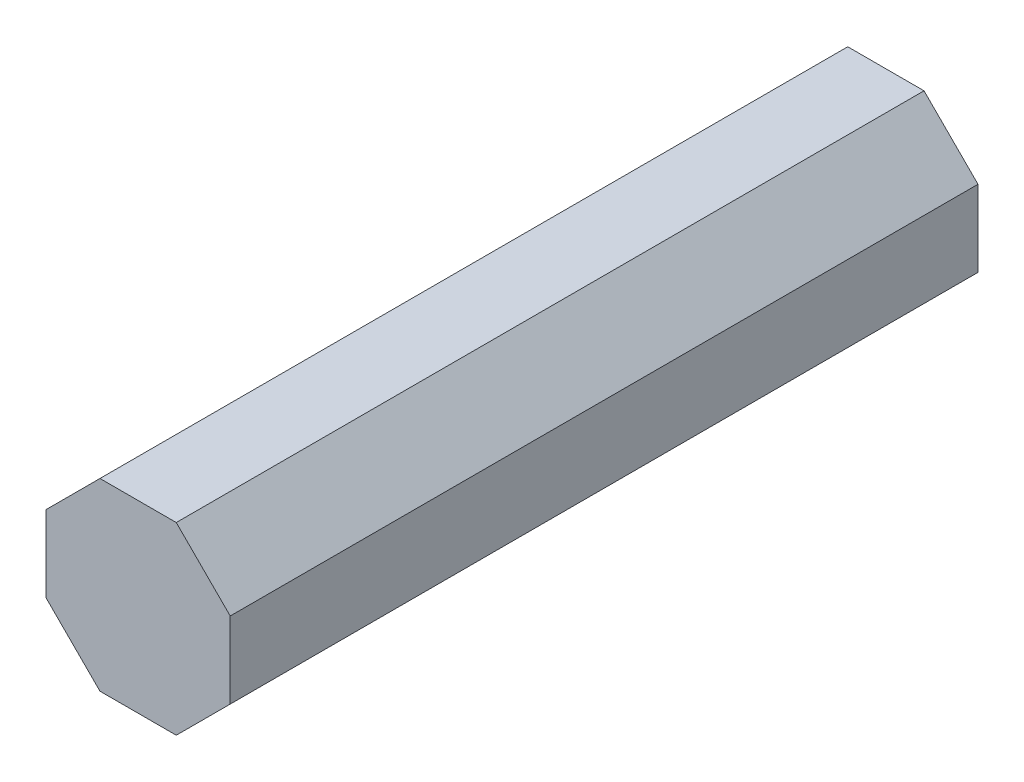
ISO-10303-21;
HEADER;
FILE_DESCRIPTION(('STEP AP214'),'2;1');
FILE_NAME('part.step','',(''),(''),'','','');
FILE_SCHEMA(('AUTOMOTIVE_DESIGN { 1 0 10303 214 1 1 1 1 }'));
ENDSEC;
DATA;
#1=APPLICATION_CONTEXT('core data for automotive mechanical design processes');
#2=APPLICATION_PROTOCOL_DEFINITION('international standard','automotive_design',2000,#1);
#3=PRODUCT_CONTEXT('',#1,'mechanical');
#4=PRODUCT('Part','Part','',(#3));
#5=PRODUCT_RELATED_PRODUCT_CATEGORY('part','',(#4));
#6=PRODUCT_DEFINITION_FORMATION('','',#4);
#7=PRODUCT_DEFINITION_CONTEXT('part definition',#1,'design');
#8=PRODUCT_DEFINITION('design','',#6,#7);
#9=PRODUCT_DEFINITION_SHAPE('','',#8);
#10=(LENGTH_UNIT() NAMED_UNIT(*) SI_UNIT(.MILLI.,.METRE.));
#11=(NAMED_UNIT(*) PLANE_ANGLE_UNIT() SI_UNIT($,.RADIAN.));
#12=(NAMED_UNIT(*) SI_UNIT($,.STERADIAN.) SOLID_ANGLE_UNIT());
#13=UNCERTAINTY_MEASURE_WITH_UNIT(LENGTH_MEASURE(1.E-05),#10,'distance_accuracy_value','');
#14=(GEOMETRIC_REPRESENTATION_CONTEXT(3) GLOBAL_UNCERTAINTY_ASSIGNED_CONTEXT((#13)) GLOBAL_UNIT_ASSIGNED_CONTEXT((#10,
#11,#12)) REPRESENTATION_CONTEXT('',''));
#15=CARTESIAN_POINT('',(0.,0.,0.));
#16=DIRECTION('',(0.,0.,1.));
#17=DIRECTION('',(1.,0.,0.));
#18=AXIS2_PLACEMENT_3D('',#15,#16,#17);
#19=CARTESIAN_POINT('',(3.69551813004515,1.53073372946036,30.));
#20=DIRECTION('',(-0.707106781186547,-0.707106781186547,0.));
#21=DIRECTION('',(0.707106781186548,-0.707106781186548,0.));
#22=AXIS2_PLACEMENT_3D('',#19,#20,#21);
#23=PLANE('',#22);
#24=DIRECTION('',(-0.707106781186548,0.707106781186548,0.));
#25=VECTOR('',#24,1.);
#26=CARTESIAN_POINT('',(3.69551813004515,1.53073372946036,0.));
#27=LINE('',#26,#25);
#28=CARTESIAN_POINT('',(3.69551813004515,1.53073372946036,0.));
#29=VERTEX_POINT('',#28);
#30=CARTESIAN_POINT('',(1.53073372946036,3.69551813004515,0.));
#31=VERTEX_POINT('',#30);
#32=EDGE_CURVE('E140',#29,#31,#27,.T.);
#33=ORIENTED_EDGE('',*,*,#32,.T.);
#34=DIRECTION('',(0.,0.,-1.));
#35=VECTOR('',#34,1.);
#36=CARTESIAN_POINT('',(1.53073372946036,3.69551813004515,30.));
#37=LINE('',#36,#35);
#38=CARTESIAN_POINT('',(1.53073372946036,3.69551813004515,30.));
#39=VERTEX_POINT('',#38);
#40=EDGE_CURVE('E11',#39,#31,#37,.T.);
#41=ORIENTED_EDGE('',*,*,#40,.F.);
#42=DIRECTION('',(-0.707106781186548,0.707106781186548,0.));
#43=VECTOR('',#42,1.);
#44=CARTESIAN_POINT('',(3.69551813004515,1.53073372946036,30.));
#45=LINE('',#44,#43);
#46=CARTESIAN_POINT('',(3.69551813004515,1.53073372946036,30.));
#47=VERTEX_POINT('',#46);
#48=EDGE_CURVE('E162',#47,#39,#45,.T.);
#49=ORIENTED_EDGE('',*,*,#48,.F.);
#50=DIRECTION('',(0.,0.,-1.));
#51=VECTOR('',#50,1.);
#52=CARTESIAN_POINT('',(3.69551813004515,1.53073372946036,30.));
#53=LINE('',#52,#51);
#54=EDGE_CURVE('E136',#47,#29,#53,.T.);
#55=ORIENTED_EDGE('',*,*,#54,.T.);
#56=EDGE_LOOP('',(#33,#41,#49,#55));
#57=FACE_BOUND('',#56,.T.);
#58=ADVANCED_FACE('F39',(#57),#23,.F.);
#59=CARTESIAN_POINT('',(1.53073372946036,3.69551813004515,30.));
#60=DIRECTION('',(0.,-1.,0.));
#61=DIRECTION('',(1.,0.,0.));
#62=AXIS2_PLACEMENT_3D('',#59,#60,#61);
#63=PLANE('',#62);
#64=DIRECTION('',(-1.,0.,0.));
#65=VECTOR('',#64,1.);
#66=CARTESIAN_POINT('',(1.53073372946036,3.69551813004515,0.));
#67=LINE('',#66,#65);
#68=CARTESIAN_POINT('',(-1.53073372946036,3.69551813004515,0.));
#69=VERTEX_POINT('',#68);
#70=EDGE_CURVE('E144',#31,#69,#67,.T.);
#71=ORIENTED_EDGE('',*,*,#70,.T.);
#72=DIRECTION('',(0.,0.,-1.));
#73=VECTOR('',#72,1.);
#74=CARTESIAN_POINT('',(-1.53073372946036,3.69551813004515,30.));
#75=LINE('',#74,#73);
#76=CARTESIAN_POINT('',(-1.53073372946036,3.69551813004515,30.));
#77=VERTEX_POINT('',#76);
#78=EDGE_CURVE('E48',#77,#69,#75,.T.);
#79=ORIENTED_EDGE('',*,*,#78,.F.);
#80=DIRECTION('',(-1.,0.,0.));
#81=VECTOR('',#80,1.);
#82=CARTESIAN_POINT('',(1.53073372946036,3.69551813004515,30.));
#83=LINE('',#82,#81);
#84=EDGE_CURVE('E99',#39,#77,#83,.T.);
#85=ORIENTED_EDGE('',*,*,#84,.F.);
#86=ORIENTED_EDGE('',*,*,#40,.T.);
#87=EDGE_LOOP('',(#71,#79,#85,#86));
#88=FACE_BOUND('',#87,.T.);
#89=ADVANCED_FACE('F208',(#88),#63,.F.);
#90=CARTESIAN_POINT('',(-1.53073372946036,3.69551813004515,30.));
#91=DIRECTION('',(0.707106781186548,-0.707106781186547,0.));
#92=DIRECTION('',(0.707106781186547,0.707106781186548,0.));
#93=AXIS2_PLACEMENT_3D('',#90,#91,#92);
#94=PLANE('',#93);
#95=DIRECTION('',(-0.707106781186547,-0.707106781186548,0.));
#96=VECTOR('',#95,1.);
#97=CARTESIAN_POINT('',(-1.53073372946036,3.69551813004515,0.));
#98=LINE('',#97,#96);
#99=CARTESIAN_POINT('',(-3.69551813004515,1.53073372946036,0.));
#100=VERTEX_POINT('',#99);
#101=EDGE_CURVE('E147',#69,#100,#98,.T.);
#102=ORIENTED_EDGE('',*,*,#101,.T.);
#103=DIRECTION('',(0.,0.,-1.));
#104=VECTOR('',#103,1.);
#105=CARTESIAN_POINT('',(-3.69551813004515,1.53073372946036,30.));
#106=LINE('',#105,#104);
#107=CARTESIAN_POINT('',(-3.69551813004515,1.53073372946036,30.));
#108=VERTEX_POINT('',#107);
#109=EDGE_CURVE('E173',#108,#100,#106,.T.);
#110=ORIENTED_EDGE('',*,*,#109,.F.);
#111=DIRECTION('',(-0.707106781186547,-0.707106781186548,0.));
#112=VECTOR('',#111,1.);
#113=CARTESIAN_POINT('',(-1.53073372946036,3.69551813004515,30.));
#114=LINE('',#113,#112);
#115=EDGE_CURVE('E183',#77,#108,#114,.T.);
#116=ORIENTED_EDGE('',*,*,#115,.F.);
#117=ORIENTED_EDGE('',*,*,#78,.T.);
#118=EDGE_LOOP('',(#102,#110,#116,#117));
#119=FACE_BOUND('',#118,.T.);
#120=ADVANCED_FACE('F181',(#119),#94,.F.);
#121=CARTESIAN_POINT('',(-3.69551813004515,1.53073372946036,30.));
#122=DIRECTION('',(1.,0.,0.));
#123=DIRECTION('',(0.,1.,0.));
#124=AXIS2_PLACEMENT_3D('',#121,#122,#123);
#125=PLANE('',#124);
#126=DIRECTION('',(0.,-1.,0.));
#127=VECTOR('',#126,1.);
#128=CARTESIAN_POINT('',(-3.69551813004515,1.53073372946036,0.));
#129=LINE('',#128,#127);
#130=CARTESIAN_POINT('',(-3.69551813004515,-1.53073372946036,0.));
#131=VERTEX_POINT('',#130);
#132=EDGE_CURVE('E150',#100,#131,#129,.T.);
#133=ORIENTED_EDGE('',*,*,#132,.T.);
#134=DIRECTION('',(0.,0.,-1.));
#135=VECTOR('',#134,1.);
#136=CARTESIAN_POINT('',(-3.69551813004515,-1.53073372946036,30.));
#137=LINE('',#136,#135);
#138=CARTESIAN_POINT('',(-3.69551813004515,-1.53073372946036,30.));
#139=VERTEX_POINT('',#138);
#140=EDGE_CURVE('E169',#139,#131,#137,.T.);
#141=ORIENTED_EDGE('',*,*,#140,.F.);
#142=DIRECTION('',(0.,-1.,0.));
#143=VECTOR('',#142,1.);
#144=CARTESIAN_POINT('',(-3.69551813004515,1.53073372946036,30.));
#145=LINE('',#144,#143);
#146=EDGE_CURVE('E196',#108,#139,#145,.T.);
#147=ORIENTED_EDGE('',*,*,#146,.F.);
#148=ORIENTED_EDGE('',*,*,#109,.T.);
#149=EDGE_LOOP('',(#133,#141,#147,#148));
#150=FACE_BOUND('',#149,.T.);
#151=ADVANCED_FACE('F191',(#150),#125,.F.);
#152=CARTESIAN_POINT('',(-3.69551813004515,-1.53073372946036,30.));
#153=DIRECTION('',(0.707106781186547,0.707106781186548,0.));
#154=DIRECTION('',(-0.707106781186548,0.707106781186547,0.));
#155=AXIS2_PLACEMENT_3D('',#152,#153,#154);
#156=PLANE('',#155);
#157=DIRECTION('',(0.707106781186548,-0.707106781186547,0.));
#158=VECTOR('',#157,1.);
#159=CARTESIAN_POINT('',(-3.69551813004515,-1.53073372946036,0.));
#160=LINE('',#159,#158);
#161=CARTESIAN_POINT('',(-1.53073372946036,-3.69551813004515,0.));
#162=VERTEX_POINT('',#161);
#163=EDGE_CURVE('E153',#131,#162,#160,.T.);
#164=ORIENTED_EDGE('',*,*,#163,.T.);
#165=DIRECTION('',(0.,0.,-1.));
#166=VECTOR('',#165,1.);
#167=CARTESIAN_POINT('',(-1.53073372946036,-3.69551813004515,30.));
#168=LINE('',#167,#166);
#169=CARTESIAN_POINT('',(-1.53073372946036,-3.69551813004515,30.));
#170=VERTEX_POINT('',#169);
#171=EDGE_CURVE('E129',#170,#162,#168,.T.);
#172=ORIENTED_EDGE('',*,*,#171,.F.);
#173=DIRECTION('',(0.707106781186548,-0.707106781186547,0.));
#174=VECTOR('',#173,1.);
#175=CARTESIAN_POINT('',(-3.69551813004515,-1.53073372946036,30.));
#176=LINE('',#175,#174);
#177=EDGE_CURVE('E118',#139,#170,#176,.T.);
#178=ORIENTED_EDGE('',*,*,#177,.F.);
#179=ORIENTED_EDGE('',*,*,#140,.T.);
#180=EDGE_LOOP('',(#164,#172,#178,#179));
#181=FACE_BOUND('',#180,.T.);
#182=ADVANCED_FACE('F194',(#181),#156,.F.);
#183=CARTESIAN_POINT('',(-1.53073372946036,-3.69551813004515,30.));
#184=DIRECTION('',(0.,1.,0.));
#185=DIRECTION('',(-1.,0.,0.));
#186=AXIS2_PLACEMENT_3D('',#183,#184,#185);
#187=PLANE('',#186);
#188=DIRECTION('',(1.,0.,0.));
#189=VECTOR('',#188,1.);
#190=CARTESIAN_POINT('',(-1.53073372946036,-3.69551813004515,0.));
#191=LINE('',#190,#189);
#192=CARTESIAN_POINT('',(1.53073372946036,-3.69551813004515,0.));
#193=VERTEX_POINT('',#192);
#194=EDGE_CURVE('E127',#162,#193,#191,.T.);
#195=ORIENTED_EDGE('',*,*,#194,.T.);
#196=DIRECTION('',(0.,0.,-1.));
#197=VECTOR('',#196,1.);
#198=CARTESIAN_POINT('',(1.53073372946036,-3.69551813004515,30.));
#199=LINE('',#198,#197);
#200=CARTESIAN_POINT('',(1.53073372946036,-3.69551813004515,30.));
#201=VERTEX_POINT('',#200);
#202=EDGE_CURVE('E124',#201,#193,#199,.T.);
#203=ORIENTED_EDGE('',*,*,#202,.F.);
#204=DIRECTION('',(1.,0.,0.));
#205=VECTOR('',#204,1.);
#206=CARTESIAN_POINT('',(-1.53073372946036,-3.69551813004515,30.));
#207=LINE('',#206,#205);
#208=EDGE_CURVE('E112',#170,#201,#207,.T.);
#209=ORIENTED_EDGE('',*,*,#208,.F.);
#210=ORIENTED_EDGE('',*,*,#171,.T.);
#211=EDGE_LOOP('',(#195,#203,#209,#210));
#212=FACE_BOUND('',#211,.T.);
#213=ADVANCED_FACE('F125',(#212),#187,.F.);
#214=CARTESIAN_POINT('',(1.53073372946036,-3.69551813004515,30.));
#215=DIRECTION('',(-0.707106781186547,0.707106781186548,0.));
#216=DIRECTION('',(-0.707106781186548,-0.707106781186547,0.));
#217=AXIS2_PLACEMENT_3D('',#214,#215,#216);
#218=PLANE('',#217);
#219=DIRECTION('',(0.707106781186548,0.707106781186547,0.));
#220=VECTOR('',#219,1.);
#221=CARTESIAN_POINT('',(1.53073372946036,-3.69551813004515,0.));
#222=LINE('',#221,#220);
#223=CARTESIAN_POINT('',(3.69551813004515,-1.53073372946036,0.));
#224=VERTEX_POINT('',#223);
#225=EDGE_CURVE('E85',#193,#224,#222,.T.);
#226=ORIENTED_EDGE('',*,*,#225,.T.);
#227=DIRECTION('',(0.,0.,-1.));
#228=VECTOR('',#227,1.);
#229=CARTESIAN_POINT('',(3.69551813004515,-1.53073372946036,30.));
#230=LINE('',#229,#228);
#231=CARTESIAN_POINT('',(3.69551813004515,-1.53073372946036,30.));
#232=VERTEX_POINT('',#231);
#233=EDGE_CURVE('E130',#232,#224,#230,.T.);
#234=ORIENTED_EDGE('',*,*,#233,.F.);
#235=DIRECTION('',(0.707106781186548,0.707106781186547,0.));
#236=VECTOR('',#235,1.);
#237=CARTESIAN_POINT('',(1.53073372946036,-3.69551813004515,30.));
#238=LINE('',#237,#236);
#239=EDGE_CURVE('E116',#201,#232,#238,.T.);
#240=ORIENTED_EDGE('',*,*,#239,.F.);
#241=ORIENTED_EDGE('',*,*,#202,.T.);
#242=EDGE_LOOP('',(#226,#234,#240,#241));
#243=FACE_BOUND('',#242,.T.);
#244=ADVANCED_FACE('F132',(#243),#218,.F.);
#245=CARTESIAN_POINT('',(3.69551813004515,-1.53073372946036,30.));
#246=DIRECTION('',(-1.,0.,0.));
#247=DIRECTION('',(0.,-1.,0.));
#248=AXIS2_PLACEMENT_3D('',#245,#246,#247);
#249=PLANE('',#248);
#250=DIRECTION('',(0.,1.,0.));
#251=VECTOR('',#250,1.);
#252=CARTESIAN_POINT('',(3.69551813004515,-1.53073372946036,0.));
#253=LINE('',#252,#251);
#254=EDGE_CURVE('E91',#224,#29,#253,.T.);
#255=ORIENTED_EDGE('',*,*,#254,.T.);
#256=ORIENTED_EDGE('',*,*,#54,.F.);
#257=DIRECTION('',(0.,1.,0.));
#258=VECTOR('',#257,1.);
#259=CARTESIAN_POINT('',(3.69551813004515,-1.53073372946036,30.));
#260=LINE('',#259,#258);
#261=EDGE_CURVE('E56',#232,#47,#260,.T.);
#262=ORIENTED_EDGE('',*,*,#261,.F.);
#263=ORIENTED_EDGE('',*,*,#233,.T.);
#264=EDGE_LOOP('',(#255,#256,#262,#263));
#265=FACE_BOUND('',#264,.T.);
#266=ADVANCED_FACE('F224',(#265),#249,.F.);
#267=CARTESIAN_POINT('',(0.,0.,30.));
#268=DIRECTION('',(0.,0.,1.));
#269=DIRECTION('',(1.,0.,0.));
#270=AXIS2_PLACEMENT_3D('',#267,#268,#269);
#271=PLANE('',#270);
#272=ORIENTED_EDGE('',*,*,#48,.T.);
#273=ORIENTED_EDGE('',*,*,#84,.T.);
#274=ORIENTED_EDGE('',*,*,#115,.T.);
#275=ORIENTED_EDGE('',*,*,#146,.T.);
#276=ORIENTED_EDGE('',*,*,#177,.T.);
#277=ORIENTED_EDGE('',*,*,#208,.T.);
#278=ORIENTED_EDGE('',*,*,#239,.T.);
#279=ORIENTED_EDGE('',*,*,#261,.T.);
#280=EDGE_LOOP('',(#272,#273,#274,#275,#276,#277,#278,#279));
#281=FACE_BOUND('',#280,.T.);
#282=ADVANCED_FACE('F114',(#281),#271,.T.);
#283=CARTESIAN_POINT('',(0.,0.,0.));
#284=DIRECTION('',(0.,0.,1.));
#285=DIRECTION('',(1.,0.,0.));
#286=AXIS2_PLACEMENT_3D('',#283,#284,#285);
#287=PLANE('',#286);
#288=ORIENTED_EDGE('',*,*,#32,.F.);
#289=ORIENTED_EDGE('',*,*,#254,.F.);
#290=ORIENTED_EDGE('',*,*,#225,.F.);
#291=ORIENTED_EDGE('',*,*,#194,.F.);
#292=ORIENTED_EDGE('',*,*,#163,.F.);
#293=ORIENTED_EDGE('',*,*,#132,.F.);
#294=ORIENTED_EDGE('',*,*,#101,.F.);
#295=ORIENTED_EDGE('',*,*,#70,.F.);
#296=EDGE_LOOP('',(#288,#289,#290,#291,#292,#293,#294,#295));
#297=FACE_BOUND('',#296,.T.);
#298=ADVANCED_FACE('F187',(#297),#287,.F.);
#299=CLOSED_SHELL('',(#58,#89,#120,#151,#182,#213,#244,#266,#282,#298));
#300=MANIFOLD_SOLID_BREP('B2',#299);
#301=ADVANCED_BREP_SHAPE_REPRESENTATION('',(#18,#300),#14);
#302=SHAPE_DEFINITION_REPRESENTATION(#9,#301);
ENDSEC;
END-ISO-10303-21;
